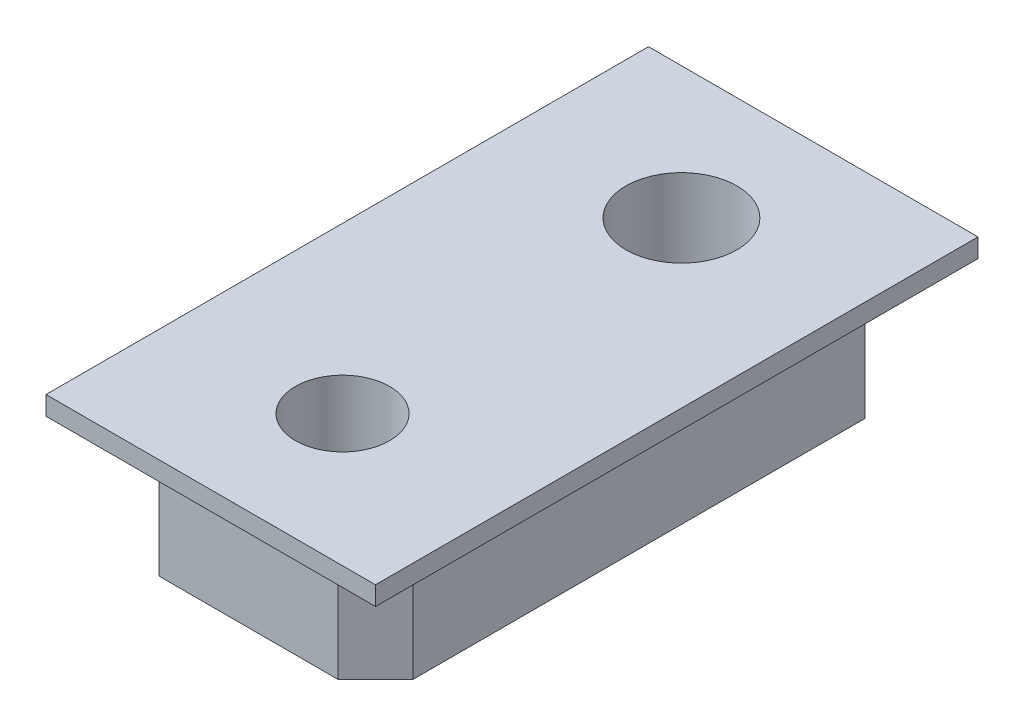
ISO-10303-21;
HEADER;
FILE_DESCRIPTION(('STEP AP214'),'2;1');
FILE_NAME('part.step','',(''),(''),'','','');
FILE_SCHEMA(('AUTOMOTIVE_DESIGN { 1 0 10303 214 1 1 1 1 }'));
ENDSEC;
DATA;
#1=APPLICATION_CONTEXT('core data for automotive mechanical design processes');
#2=APPLICATION_PROTOCOL_DEFINITION('international standard','automotive_design',2000,#1);
#3=PRODUCT_CONTEXT('',#1,'mechanical');
#4=PRODUCT('Part','Part','',(#3));
#5=PRODUCT_RELATED_PRODUCT_CATEGORY('part','',(#4));
#6=PRODUCT_DEFINITION_FORMATION('','',#4);
#7=PRODUCT_DEFINITION_CONTEXT('part definition',#1,'design');
#8=PRODUCT_DEFINITION('design','',#6,#7);
#9=PRODUCT_DEFINITION_SHAPE('','',#8);
#10=(LENGTH_UNIT() NAMED_UNIT(*) SI_UNIT(.MILLI.,.METRE.));
#11=(NAMED_UNIT(*) PLANE_ANGLE_UNIT() SI_UNIT($,.RADIAN.));
#12=(NAMED_UNIT(*) SI_UNIT($,.STERADIAN.) SOLID_ANGLE_UNIT());
#13=UNCERTAINTY_MEASURE_WITH_UNIT(LENGTH_MEASURE(1.E-05),#10,'distance_accuracy_value','');
#14=(GEOMETRIC_REPRESENTATION_CONTEXT(3) GLOBAL_UNCERTAINTY_ASSIGNED_CONTEXT((#13)) GLOBAL_UNIT_ASSIGNED_CONTEXT((#10,
#11,#12)) REPRESENTATION_CONTEXT('',''));
#15=CARTESIAN_POINT('',(0.,0.,0.));
#16=DIRECTION('',(0.,0.,1.));
#17=DIRECTION('',(1.,0.,0.));
#18=AXIS2_PLACEMENT_3D('',#15,#16,#17);
#19=CARTESIAN_POINT('',(3.37499999999999,114.,7.00000000000002));
#20=DIRECTION('',(0.,1.,0.));
#21=DIRECTION('',(0.,0.,1.));
#22=AXIS2_PLACEMENT_3D('',#19,#20,#21);
#23=PLANE('',#22);
#24=CARTESIAN_POINT('',(0.,114.,4.50000000000001));
#25=DIRECTION('',(0.,1.,0.));
#26=DIRECTION('',(0.,0.,1.));
#27=AXIS2_PLACEMENT_3D('',#24,#25,#26);
#28=CIRCLE('',#27,1.25);
#29=CARTESIAN_POINT('',(0.,114.,5.75000000000002));
#30=VERTEX_POINT('',#29);
#31=EDGE_CURVE('E500',#30,#30,#28,.T.);
#32=ORIENTED_EDGE('',*,*,#31,.T.);
#33=EDGE_LOOP('',(#32));
#34=FACE_BOUND('',#33,.T.);
#35=CARTESIAN_POINT('',(0.,114.,-4.5));
#36=DIRECTION('',(0.,1.,0.));
#37=DIRECTION('',(0.,0.,1.));
#38=AXIS2_PLACEMENT_3D('',#35,#36,#37);
#39=CIRCLE('',#38,1.4732);
#40=CARTESIAN_POINT('',(0.,114.,-3.0268));
#41=VERTEX_POINT('',#40);
#42=EDGE_CURVE('E494',#41,#41,#39,.T.);
#43=ORIENTED_EDGE('',*,*,#42,.T.);
#44=EDGE_LOOP('',(#43));
#45=FACE_BOUND('',#44,.T.);
#46=DIRECTION('',(1.,0.,0.));
#47=VECTOR('',#46,1.);
#48=CARTESIAN_POINT('',(3.37499999999999,114.,-7.00000000000002));
#49=LINE('',#48,#47);
#50=CARTESIAN_POINT('',(-2.37499999999999,114.,-7.00000000000002));
#51=VERTEX_POINT('',#50);
#52=CARTESIAN_POINT('',(2.37499999999999,114.,-7.00000000000002));
#53=VERTEX_POINT('',#52);
#54=EDGE_CURVE('E242',#51,#53,#49,.T.);
#55=ORIENTED_EDGE('',*,*,#54,.T.);
#56=DIRECTION('',(-0.707106781186549,0.,-0.707106781186548));
#57=VECTOR('',#56,1.);
#58=CARTESIAN_POINT('',(3.37499999999999,114.,-6.));
#59=LINE('',#58,#57);
#60=CARTESIAN_POINT('',(3.37499999999999,114.,-6.));
#61=VERTEX_POINT('',#60);
#62=EDGE_CURVE('E285',#53,#61,#59,.F.);
#63=ORIENTED_EDGE('',*,*,#62,.T.);
#64=DIRECTION('',(0.,0.,-1.));
#65=VECTOR('',#64,1.);
#66=CARTESIAN_POINT('',(3.37499999999999,114.,7.00000000000002));
#67=LINE('',#66,#65);
#68=CARTESIAN_POINT('',(3.37499999999999,114.,6.00000000000001));
#69=VERTEX_POINT('',#68);
#70=EDGE_CURVE('E267',#69,#61,#67,.T.);
#71=ORIENTED_EDGE('',*,*,#70,.F.);
#72=DIRECTION('',(-0.707106781186546,0.,0.707106781186551));
#73=VECTOR('',#72,1.);
#74=CARTESIAN_POINT('',(2.37499999999999,114.,7.00000000000002));
#75=LINE('',#74,#73);
#76=CARTESIAN_POINT('',(2.37499999999999,114.,7.00000000000002));
#77=VERTEX_POINT('',#76);
#78=EDGE_CURVE('E279',#69,#77,#75,.T.);
#79=ORIENTED_EDGE('',*,*,#78,.T.);
#80=DIRECTION('',(1.,0.,0.));
#81=VECTOR('',#80,1.);
#82=CARTESIAN_POINT('',(3.37499999999999,114.,7.00000000000002));
#83=LINE('',#82,#81);
#84=CARTESIAN_POINT('',(-2.37499999999999,114.,7.00000000000002));
#85=VERTEX_POINT('',#84);
#86=EDGE_CURVE('E251',#85,#77,#83,.T.);
#87=ORIENTED_EDGE('',*,*,#86,.F.);
#88=DIRECTION('',(-0.707106781186546,0.,-0.707106781186551));
#89=VECTOR('',#88,1.);
#90=CARTESIAN_POINT('',(-2.37499999999999,114.,7.00000000000002));
#91=LINE('',#90,#89);
#92=CARTESIAN_POINT('',(-3.37499999999999,114.,6.00000000000001));
#93=VERTEX_POINT('',#92);
#94=EDGE_CURVE('E281',#85,#93,#91,.T.);
#95=ORIENTED_EDGE('',*,*,#94,.T.);
#96=DIRECTION('',(0.,0.,-1.));
#97=VECTOR('',#96,1.);
#98=CARTESIAN_POINT('',(-3.37499999999999,114.,7.00000000000002));
#99=LINE('',#98,#97);
#100=CARTESIAN_POINT('',(-3.37499999999999,114.,-6.));
#101=VERTEX_POINT('',#100);
#102=EDGE_CURVE('E255',#93,#101,#99,.T.);
#103=ORIENTED_EDGE('',*,*,#102,.T.);
#104=DIRECTION('',(-0.707106781186549,0.,0.707106781186548));
#105=VECTOR('',#104,1.);
#106=CARTESIAN_POINT('',(-3.37499999999999,114.,-6.));
#107=LINE('',#106,#105);
#108=EDGE_CURVE('E283',#101,#51,#107,.F.);
#109=ORIENTED_EDGE('',*,*,#108,.T.);
#110=EDGE_LOOP('',(#55,#63,#71,#79,#87,#95,#103,#109));
#111=FACE_BOUND('',#110,.T.);
#112=ADVANCED_FACE('F128',(#34,#45,#111),#23,.F.);
#113=CARTESIAN_POINT('',(3.37499999999999,117.175,7.00000000000002));
#114=DIRECTION('',(-1.,0.,0.));
#115=DIRECTION('',(0.,0.,1.));
#116=AXIS2_PLACEMENT_3D('',#113,#114,#115);
#117=PLANE('',#116);
#118=ORIENTED_EDGE('',*,*,#70,.T.);
#119=DIRECTION('',(0.,1.,0.));
#120=VECTOR('',#119,1.);
#121=CARTESIAN_POINT('',(3.37499999999999,117.175,-6.00000000000002));
#122=LINE('',#121,#120);
#123=CARTESIAN_POINT('',(3.37499999999999,117.175,-6.00000000000002));
#124=VERTEX_POINT('',#123);
#125=EDGE_CURVE('E272',#61,#124,#122,.T.);
#126=ORIENTED_EDGE('',*,*,#125,.T.);
#127=DIRECTION('',(0.,0.,-1.));
#128=VECTOR('',#127,1.);
#129=CARTESIAN_POINT('',(3.37499999999999,117.175,7.00000000000002));
#130=LINE('',#129,#128);
#131=CARTESIAN_POINT('',(3.37499999999999,117.175,6.));
#132=VERTEX_POINT('',#131);
#133=EDGE_CURVE('E264',#132,#124,#130,.T.);
#134=ORIENTED_EDGE('',*,*,#133,.F.);
#135=DIRECTION('',(0.,-1.,0.));
#136=VECTOR('',#135,1.);
#137=CARTESIAN_POINT('',(3.37499999999999,114.,6.00000000000001));
#138=LINE('',#137,#136);
#139=EDGE_CURVE('E270',#132,#69,#138,.T.);
#140=ORIENTED_EDGE('',*,*,#139,.T.);
#141=EDGE_LOOP('',(#118,#126,#134,#140));
#142=FACE_BOUND('',#141,.T.);
#143=ADVANCED_FACE('F324',(#142),#117,.F.);
#144=CARTESIAN_POINT('',(-3.37499999999999,114.,7.00000000000002));
#145=DIRECTION('',(1.,0.,0.));
#146=DIRECTION('',(0.,1.,0.));
#147=AXIS2_PLACEMENT_3D('',#144,#145,#146);
#148=PLANE('',#147);
#149=DIRECTION('',(0.,0.,-1.));
#150=VECTOR('',#149,1.);
#151=CARTESIAN_POINT('',(-3.37499999999999,117.175,7.00000000000002));
#152=LINE('',#151,#150);
#153=CARTESIAN_POINT('',(-3.37499999999999,117.175,6.));
#154=VERTEX_POINT('',#153);
#155=CARTESIAN_POINT('',(-3.37499999999999,117.175,-6.00000000000002));
#156=VERTEX_POINT('',#155);
#157=EDGE_CURVE('E261',#154,#156,#152,.T.);
#158=ORIENTED_EDGE('',*,*,#157,.T.);
#159=DIRECTION('',(0.,-1.,0.));
#160=VECTOR('',#159,1.);
#161=CARTESIAN_POINT('',(-3.37499999999999,114.,-6.));
#162=LINE('',#161,#160);
#163=EDGE_CURVE('E289',#156,#101,#162,.T.);
#164=ORIENTED_EDGE('',*,*,#163,.T.);
#165=ORIENTED_EDGE('',*,*,#102,.F.);
#166=DIRECTION('',(0.,1.,0.));
#167=VECTOR('',#166,1.);
#168=CARTESIAN_POINT('',(-3.37499999999999,117.175,6.));
#169=LINE('',#168,#167);
#170=EDGE_CURVE('E287',#93,#154,#169,.T.);
#171=ORIENTED_EDGE('',*,*,#170,.T.);
#172=EDGE_LOOP('',(#158,#164,#165,#171));
#173=FACE_BOUND('',#172,.T.);
#174=ADVANCED_FACE('F308',(#173),#148,.F.);
#175=CARTESIAN_POINT('',(3.37499999999999,114.,7.00000000000002));
#176=DIRECTION('',(0.,0.,1.));
#177=DIRECTION('',(1.,0.,0.));
#178=AXIS2_PLACEMENT_3D('',#175,#176,#177);
#179=PLANE('',#178);
#180=DIRECTION('',(-1.,0.,0.));
#181=VECTOR('',#180,1.);
#182=CARTESIAN_POINT('',(-3.37499999999999,117.175,7.00000000000002));
#183=LINE('',#182,#181);
#184=CARTESIAN_POINT('',(2.37499999999999,117.175,7.00000000000002));
#185=VERTEX_POINT('',#184);
#186=CARTESIAN_POINT('',(-2.37499999999999,117.175,7.00000000000002));
#187=VERTEX_POINT('',#186);
#188=EDGE_CURVE('E254',#185,#187,#183,.T.);
#189=ORIENTED_EDGE('',*,*,#188,.T.);
#190=DIRECTION('',(0.,-1.,0.));
#191=VECTOR('',#190,1.);
#192=CARTESIAN_POINT('',(-2.37499999999999,114.,7.00000000000002));
#193=LINE('',#192,#191);
#194=EDGE_CURVE('E294',#187,#85,#193,.T.);
#195=ORIENTED_EDGE('',*,*,#194,.T.);
#196=ORIENTED_EDGE('',*,*,#86,.T.);
#197=DIRECTION('',(0.,1.,0.));
#198=VECTOR('',#197,1.);
#199=CARTESIAN_POINT('',(2.37499999999999,117.175,7.00000000000002));
#200=LINE('',#199,#198);
#201=EDGE_CURVE('E292',#77,#185,#200,.T.);
#202=ORIENTED_EDGE('',*,*,#201,.T.);
#203=EDGE_LOOP('',(#189,#195,#196,#202));
#204=FACE_BOUND('',#203,.T.);
#205=ADVANCED_FACE('F328',(#204),#179,.T.);
#206=CARTESIAN_POINT('',(3.37499999999999,114.,-7.00000000000002));
#207=DIRECTION('',(0.,0.,1.));
#208=DIRECTION('',(1.,0.,0.));
#209=AXIS2_PLACEMENT_3D('',#206,#207,#208);
#210=PLANE('',#209);
#211=DIRECTION('',(-1.,0.,0.));
#212=VECTOR('',#211,1.);
#213=CARTESIAN_POINT('',(-3.37499999999999,117.175,-7.00000000000002));
#214=LINE('',#213,#212);
#215=CARTESIAN_POINT('',(2.37499999999999,117.175,-7.00000000000002));
#216=VERTEX_POINT('',#215);
#217=CARTESIAN_POINT('',(-2.37499999999999,117.175,-7.00000000000002));
#218=VERTEX_POINT('',#217);
#219=EDGE_CURVE('E245',#216,#218,#214,.T.);
#220=ORIENTED_EDGE('',*,*,#219,.F.);
#221=DIRECTION('',(0.,-1.,0.));
#222=VECTOR('',#221,1.);
#223=CARTESIAN_POINT('',(2.37499999999999,114.,-7.00000000000002));
#224=LINE('',#223,#222);
#225=EDGE_CURVE('E277',#216,#53,#224,.T.);
#226=ORIENTED_EDGE('',*,*,#225,.T.);
#227=ORIENTED_EDGE('',*,*,#54,.F.);
#228=DIRECTION('',(0.,1.,0.));
#229=VECTOR('',#228,1.);
#230=CARTESIAN_POINT('',(-2.37499999999999,114.,-7.00000000000002));
#231=LINE('',#230,#229);
#232=EDGE_CURVE('E275',#51,#218,#231,.T.);
#233=ORIENTED_EDGE('',*,*,#232,.T.);
#234=EDGE_LOOP('',(#220,#226,#227,#233));
#235=FACE_BOUND('',#234,.T.);
#236=ADVANCED_FACE('F316',(#235),#210,.F.);
#237=CARTESIAN_POINT('',(4.37499999999999,117.675,8.));
#238=DIRECTION('',(-1.,0.,0.));
#239=DIRECTION('',(0.,0.,1.));
#240=AXIS2_PLACEMENT_3D('',#237,#238,#239);
#241=PLANE('',#240);
#242=DIRECTION('',(0.,0.,-1.));
#243=VECTOR('',#242,1.);
#244=CARTESIAN_POINT('',(4.37499999999999,117.175,8.00000000000001));
#245=LINE('',#244,#243);
#246=CARTESIAN_POINT('',(4.37499999999999,117.175,8.00000000000001));
#247=VERTEX_POINT('',#246);
#248=CARTESIAN_POINT('',(4.37499999999999,117.175,-8.00000000000002));
#249=VERTEX_POINT('',#248);
#250=EDGE_CURVE('E241',#247,#249,#245,.T.);
#251=ORIENTED_EDGE('',*,*,#250,.T.);
#252=DIRECTION('',(0.,-1.,0.));
#253=VECTOR('',#252,1.);
#254=CARTESIAN_POINT('',(4.37499999999999,117.675,-8.00000000000002));
#255=LINE('',#254,#253);
#256=CARTESIAN_POINT('',(4.37499999999999,117.675,-8.00000000000002));
#257=VERTEX_POINT('',#256);
#258=EDGE_CURVE('E221',#257,#249,#255,.T.);
#259=ORIENTED_EDGE('',*,*,#258,.F.);
#260=DIRECTION('',(0.,0.,-1.));
#261=VECTOR('',#260,1.);
#262=CARTESIAN_POINT('',(4.37499999999999,117.675,8.));
#263=LINE('',#262,#261);
#264=CARTESIAN_POINT('',(4.37499999999999,117.675,8.));
#265=VERTEX_POINT('',#264);
#266=EDGE_CURVE('E228',#265,#257,#263,.T.);
#267=ORIENTED_EDGE('',*,*,#266,.F.);
#268=DIRECTION('',(0.,-1.,0.));
#269=VECTOR('',#268,1.);
#270=CARTESIAN_POINT('',(4.37499999999999,117.675,8.));
#271=LINE('',#270,#269);
#272=EDGE_CURVE('E487',#265,#247,#271,.T.);
#273=ORIENTED_EDGE('',*,*,#272,.T.);
#274=EDGE_LOOP('',(#251,#259,#267,#273));
#275=FACE_BOUND('',#274,.T.);
#276=ADVANCED_FACE('F239',(#275),#241,.F.);
#277=CARTESIAN_POINT('',(4.37499999999999,117.675,-8.00000000000002));
#278=DIRECTION('',(0.,0.,1.));
#279=DIRECTION('',(1.,0.,0.));
#280=AXIS2_PLACEMENT_3D('',#277,#278,#279);
#281=PLANE('',#280);
#282=DIRECTION('',(-1.,0.,0.));
#283=VECTOR('',#282,1.);
#284=CARTESIAN_POINT('',(4.37499999999999,117.175,-8.00000000000002));
#285=LINE('',#284,#283);
#286=CARTESIAN_POINT('',(-4.37499999999999,117.175,-8.00000000000002));
#287=VERTEX_POINT('',#286);
#288=EDGE_CURVE('E485',#249,#287,#285,.T.);
#289=ORIENTED_EDGE('',*,*,#288,.T.);
#290=DIRECTION('',(0.,-1.,0.));
#291=VECTOR('',#290,1.);
#292=CARTESIAN_POINT('',(-4.37499999999999,117.675,-8.00000000000002));
#293=LINE('',#292,#291);
#294=CARTESIAN_POINT('',(-4.37499999999999,117.675,-8.00000000000002));
#295=VERTEX_POINT('',#294);
#296=EDGE_CURVE('E224',#295,#287,#293,.T.);
#297=ORIENTED_EDGE('',*,*,#296,.F.);
#298=DIRECTION('',(-1.,0.,0.));
#299=VECTOR('',#298,1.);
#300=CARTESIAN_POINT('',(4.37499999999999,117.675,-8.00000000000002));
#301=LINE('',#300,#299);
#302=EDGE_CURVE('E217',#257,#295,#301,.T.);
#303=ORIENTED_EDGE('',*,*,#302,.F.);
#304=ORIENTED_EDGE('',*,*,#258,.T.);
#305=EDGE_LOOP('',(#289,#297,#303,#304));
#306=FACE_BOUND('',#305,.T.);
#307=ADVANCED_FACE('F219',(#306),#281,.F.);
#308=CARTESIAN_POINT('',(-4.37499999999999,117.675,-8.00000000000002));
#309=DIRECTION('',(1.,0.,0.));
#310=DIRECTION('',(0.,0.,-1.));
#311=AXIS2_PLACEMENT_3D('',#308,#309,#310);
#312=PLANE('',#311);
#313=DIRECTION('',(0.,0.,1.));
#314=VECTOR('',#313,1.);
#315=CARTESIAN_POINT('',(-4.37499999999999,117.175,-8.00000000000002));
#316=LINE('',#315,#314);
#317=CARTESIAN_POINT('',(-4.37499999999999,117.175,8.00000000000001));
#318=VERTEX_POINT('',#317);
#319=EDGE_CURVE('E482',#287,#318,#316,.T.);
#320=ORIENTED_EDGE('',*,*,#319,.T.);
#321=DIRECTION('',(0.,-1.,0.));
#322=VECTOR('',#321,1.);
#323=CARTESIAN_POINT('',(-4.37499999999999,117.675,8.));
#324=LINE('',#323,#322);
#325=CARTESIAN_POINT('',(-4.37499999999999,117.675,8.));
#326=VERTEX_POINT('',#325);
#327=EDGE_CURVE('E247',#326,#318,#324,.T.);
#328=ORIENTED_EDGE('',*,*,#327,.F.);
#329=DIRECTION('',(0.,0.,1.));
#330=VECTOR('',#329,1.);
#331=CARTESIAN_POINT('',(-4.37499999999999,117.675,-8.00000000000002));
#332=LINE('',#331,#330);
#333=EDGE_CURVE('E227',#295,#326,#332,.T.);
#334=ORIENTED_EDGE('',*,*,#333,.F.);
#335=ORIENTED_EDGE('',*,*,#296,.T.);
#336=EDGE_LOOP('',(#320,#328,#334,#335));
#337=FACE_BOUND('',#336,.T.);
#338=ADVANCED_FACE('F373',(#337),#312,.F.);
#339=CARTESIAN_POINT('',(-4.37499999999999,117.675,8.));
#340=DIRECTION('',(0.,0.,-1.));
#341=DIRECTION('',(-1.,0.,0.));
#342=AXIS2_PLACEMENT_3D('',#339,#340,#341);
#343=PLANE('',#342);
#344=DIRECTION('',(1.,0.,0.));
#345=VECTOR('',#344,1.);
#346=CARTESIAN_POINT('',(-4.37499999999999,117.175,8.00000000000001));
#347=LINE('',#346,#345);
#348=EDGE_CURVE('E237',#318,#247,#347,.T.);
#349=ORIENTED_EDGE('',*,*,#348,.T.);
#350=ORIENTED_EDGE('',*,*,#272,.F.);
#351=DIRECTION('',(1.,0.,0.));
#352=VECTOR('',#351,1.);
#353=CARTESIAN_POINT('',(-4.37499999999999,117.675,8.));
#354=LINE('',#353,#352);
#355=EDGE_CURVE('E233',#326,#265,#354,.T.);
#356=ORIENTED_EDGE('',*,*,#355,.F.);
#357=ORIENTED_EDGE('',*,*,#327,.T.);
#358=EDGE_LOOP('',(#349,#350,#356,#357));
#359=FACE_BOUND('',#358,.T.);
#360=ADVANCED_FACE('F367',(#359),#343,.F.);
#361=CARTESIAN_POINT('',(4.37499999999999,117.675,-8.00000000000002));
#362=DIRECTION('',(0.,1.,0.));
#363=DIRECTION('',(0.,0.,1.));
#364=AXIS2_PLACEMENT_3D('',#361,#362,#363);
#365=PLANE('',#364);
#366=CARTESIAN_POINT('',(0.,117.675,4.5));
#367=DIRECTION('',(0.,1.,0.));
#368=DIRECTION('',(0.,0.,1.));
#369=AXIS2_PLACEMENT_3D('',#366,#367,#368);
#370=CIRCLE('',#369,1.25);
#371=CARTESIAN_POINT('',(0.,117.675,5.75000000000001));
#372=VERTEX_POINT('',#371);
#373=EDGE_CURVE('E503',#372,#372,#370,.T.);
#374=ORIENTED_EDGE('',*,*,#373,.F.);
#375=EDGE_LOOP('',(#374));
#376=FACE_BOUND('',#375,.T.);
#377=CARTESIAN_POINT('',(0.,117.675,-4.5));
#378=DIRECTION('',(0.,1.,0.));
#379=DIRECTION('',(0.,0.,1.));
#380=AXIS2_PLACEMENT_3D('',#377,#378,#379);
#381=CIRCLE('',#380,1.47319999999999);
#382=CARTESIAN_POINT('',(0.,117.675,-3.02680000000001));
#383=VERTEX_POINT('',#382);
#384=EDGE_CURVE('E496',#383,#383,#381,.T.);
#385=ORIENTED_EDGE('',*,*,#384,.F.);
#386=EDGE_LOOP('',(#385));
#387=FACE_BOUND('',#386,.T.);
#388=ORIENTED_EDGE('',*,*,#266,.T.);
#389=ORIENTED_EDGE('',*,*,#302,.T.);
#390=ORIENTED_EDGE('',*,*,#333,.T.);
#391=ORIENTED_EDGE('',*,*,#355,.T.);
#392=EDGE_LOOP('',(#388,#389,#390,#391));
#393=FACE_BOUND('',#392,.T.);
#394=ADVANCED_FACE('F231',(#376,#387,#393),#365,.T.);
#395=CARTESIAN_POINT('',(4.37499999999999,117.175,-8.00000000000002));
#396=DIRECTION('',(0.,1.,0.));
#397=DIRECTION('',(0.,0.,1.));
#398=AXIS2_PLACEMENT_3D('',#395,#396,#397);
#399=PLANE('',#398);
#400=ORIENTED_EDGE('',*,*,#188,.F.);
#401=DIRECTION('',(0.707106781186546,0.,-0.707106781186551));
#402=VECTOR('',#401,1.);
#403=CARTESIAN_POINT('',(10.875,117.175,-1.50000000000003));
#404=LINE('',#403,#402);
#405=EDGE_CURVE('E12',#185,#132,#404,.T.);
#406=ORIENTED_EDGE('',*,*,#405,.T.);
#407=ORIENTED_EDGE('',*,*,#133,.T.);
#408=DIRECTION('',(0.707106781186549,0.,0.707106781186548));
#409=VECTOR('',#408,1.);
#410=CARTESIAN_POINT('',(2.87499999999999,117.175,-6.50000000000002));
#411=LINE('',#410,#409);
#412=EDGE_CURVE('E297',#124,#216,#411,.F.);
#413=ORIENTED_EDGE('',*,*,#412,.T.);
#414=ORIENTED_EDGE('',*,*,#219,.T.);
#415=DIRECTION('',(0.707106781186549,0.,-0.707106781186548));
#416=VECTOR('',#415,1.);
#417=CARTESIAN_POINT('',(1.5,117.175,-10.875));
#418=LINE('',#417,#416);
#419=EDGE_CURVE('E299',#218,#156,#418,.F.);
#420=ORIENTED_EDGE('',*,*,#419,.T.);
#421=ORIENTED_EDGE('',*,*,#157,.F.);
#422=DIRECTION('',(0.707106781186546,0.,0.707106781186551));
#423=VECTOR('',#422,1.);
#424=CARTESIAN_POINT('',(-6.50000000000001,117.175,2.87499999999997));
#425=LINE('',#424,#423);
#426=EDGE_CURVE('E136',#154,#187,#425,.T.);
#427=ORIENTED_EDGE('',*,*,#426,.T.);
#428=EDGE_LOOP('',(#400,#406,#407,#413,#414,#420,#421,#427));
#429=FACE_BOUND('',#428,.T.);
#430=ORIENTED_EDGE('',*,*,#250,.F.);
#431=ORIENTED_EDGE('',*,*,#348,.F.);
#432=ORIENTED_EDGE('',*,*,#319,.F.);
#433=ORIENTED_EDGE('',*,*,#288,.F.);
#434=EDGE_LOOP('',(#430,#431,#432,#433));
#435=FACE_BOUND('',#434,.T.);
#436=ADVANCED_FACE('F301',(#429,#435),#399,.F.);
#437=CARTESIAN_POINT('',(0.,117.675,-4.5));
#438=DIRECTION('',(0.,1.,0.));
#439=DIRECTION('',(0.,0.,1.));
#440=AXIS2_PLACEMENT_3D('',#437,#438,#439);
#441=CYLINDRICAL_SURFACE('',#440,1.47319999999999);
#442=ORIENTED_EDGE('',*,*,#42,.F.);
#443=EDGE_LOOP('',(#442));
#444=FACE_BOUND('',#443,.T.);
#445=ORIENTED_EDGE('',*,*,#384,.T.);
#446=EDGE_LOOP('',(#445));
#447=FACE_BOUND('',#446,.T.);
#448=ADVANCED_FACE('F354',(#444,#447),#441,.F.);
#449=CARTESIAN_POINT('',(0.,114.,4.50000000000001));
#450=DIRECTION('',(0.,1.,0.));
#451=DIRECTION('',(0.,0.,1.));
#452=AXIS2_PLACEMENT_3D('',#449,#450,#451);
#453=CYLINDRICAL_SURFACE('',#452,1.25);
#454=ORIENTED_EDGE('',*,*,#31,.F.);
#455=EDGE_LOOP('',(#454));
#456=FACE_BOUND('',#455,.T.);
#457=ORIENTED_EDGE('',*,*,#373,.T.);
#458=EDGE_LOOP('',(#457));
#459=FACE_BOUND('',#458,.T.);
#460=ADVANCED_FACE('F350',(#456,#459),#453,.F.);
#461=CARTESIAN_POINT('',(3.37499999999999,117.175,-6.00000000000002));
#462=DIRECTION('',(-0.707106781186546,0.,0.707106781186551));
#463=DIRECTION('',(0.707106781186549,0.,0.707106781186548));
#464=AXIS2_PLACEMENT_3D('',#461,#462,#463);
#465=PLANE('',#464);
#466=ORIENTED_EDGE('',*,*,#62,.F.);
#467=ORIENTED_EDGE('',*,*,#225,.F.);
#468=ORIENTED_EDGE('',*,*,#412,.F.);
#469=ORIENTED_EDGE('',*,*,#125,.F.);
#470=EDGE_LOOP('',(#466,#467,#468,#469));
#471=FACE_BOUND('',#470,.T.);
#472=ADVANCED_FACE('F319',(#471),#465,.F.);
#473=CARTESIAN_POINT('',(-3.37499999999999,114.,-6.));
#474=DIRECTION('',(0.707106781186546,0.,0.707106781186551));
#475=DIRECTION('',(0.707106781186549,0.,-0.707106781186548));
#476=AXIS2_PLACEMENT_3D('',#473,#474,#475);
#477=PLANE('',#476);
#478=ORIENTED_EDGE('',*,*,#419,.F.);
#479=ORIENTED_EDGE('',*,*,#232,.F.);
#480=ORIENTED_EDGE('',*,*,#108,.F.);
#481=ORIENTED_EDGE('',*,*,#163,.F.);
#482=EDGE_LOOP('',(#478,#479,#480,#481));
#483=FACE_BOUND('',#482,.T.);
#484=ADVANCED_FACE('F311',(#483),#477,.F.);
#485=CARTESIAN_POINT('',(-2.37499999999999,114.,7.00000000000002));
#486=DIRECTION('',(-0.707106781186549,0.,0.707106781186548));
#487=DIRECTION('',(0.707106781186546,0.,0.707106781186551));
#488=AXIS2_PLACEMENT_3D('',#485,#486,#487);
#489=PLANE('',#488);
#490=ORIENTED_EDGE('',*,*,#426,.F.);
#491=ORIENTED_EDGE('',*,*,#170,.F.);
#492=ORIENTED_EDGE('',*,*,#94,.F.);
#493=ORIENTED_EDGE('',*,*,#194,.F.);
#494=EDGE_LOOP('',(#490,#491,#492,#493));
#495=FACE_BOUND('',#494,.T.);
#496=ADVANCED_FACE('F331',(#495),#489,.T.);
#497=CARTESIAN_POINT('',(2.37499999999999,114.,7.00000000000002));
#498=DIRECTION('',(0.707106781186549,0.,0.707106781186548));
#499=DIRECTION('',(0.707106781186546,0.,-0.707106781186551));
#500=AXIS2_PLACEMENT_3D('',#497,#498,#499);
#501=PLANE('',#500);
#502=ORIENTED_EDGE('',*,*,#78,.F.);
#503=ORIENTED_EDGE('',*,*,#139,.F.);
#504=ORIENTED_EDGE('',*,*,#405,.F.);
#505=ORIENTED_EDGE('',*,*,#201,.F.);
#506=EDGE_LOOP('',(#502,#503,#504,#505));
#507=FACE_BOUND('',#506,.T.);
#508=ADVANCED_FACE('F130',(#507),#501,.T.);
#509=CLOSED_SHELL('',(#112,#143,#174,#205,#236,#276,#307,#338,#360,#394,#436,#448,#460,#472,
#484,#496,#508));
#510=MANIFOLD_SOLID_BREP('B2',#509);
#511=ADVANCED_BREP_SHAPE_REPRESENTATION('',(#18,#510),#14);
#512=SHAPE_DEFINITION_REPRESENTATION(#9,#511);
ENDSEC;
END-ISO-10303-21;
